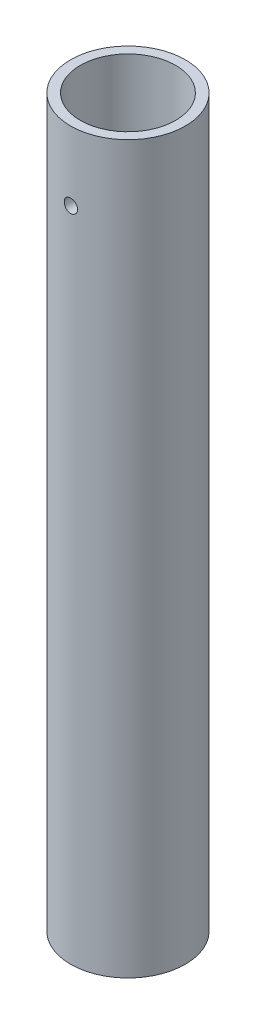
ISO-10303-21;
HEADER;
FILE_DESCRIPTION(('STEP AP214'),'2;1');
FILE_NAME('part.step','',(''),(''),'','','');
FILE_SCHEMA(('AUTOMOTIVE_DESIGN { 1 0 10303 214 1 1 1 1 }'));
ENDSEC;
DATA;
#1=APPLICATION_CONTEXT('core data for automotive mechanical design processes');
#2=APPLICATION_PROTOCOL_DEFINITION('international standard','automotive_design',2000,#1);
#3=PRODUCT_CONTEXT('',#1,'mechanical');
#4=PRODUCT('Part','Part','',(#3));
#5=PRODUCT_RELATED_PRODUCT_CATEGORY('part','',(#4));
#6=PRODUCT_DEFINITION_FORMATION('','',#4);
#7=PRODUCT_DEFINITION_CONTEXT('part definition',#1,'design');
#8=PRODUCT_DEFINITION('design','',#6,#7);
#9=PRODUCT_DEFINITION_SHAPE('','',#8);
#10=(LENGTH_UNIT() NAMED_UNIT(*) SI_UNIT(.MILLI.,.METRE.));
#11=(NAMED_UNIT(*) PLANE_ANGLE_UNIT() SI_UNIT($,.RADIAN.));
#12=(NAMED_UNIT(*) SI_UNIT($,.STERADIAN.) SOLID_ANGLE_UNIT());
#13=UNCERTAINTY_MEASURE_WITH_UNIT(LENGTH_MEASURE(1.E-05),#10,'distance_accuracy_value','');
#14=(GEOMETRIC_REPRESENTATION_CONTEXT(3) GLOBAL_UNCERTAINTY_ASSIGNED_CONTEXT((#13)) GLOBAL_UNIT_ASSIGNED_CONTEXT((#10,
#11,#12)) REPRESENTATION_CONTEXT('',''));
#15=CARTESIAN_POINT('',(0.,0.,0.));
#16=DIRECTION('',(0.,0.,1.));
#17=DIRECTION('',(1.,0.,0.));
#18=AXIS2_PLACEMENT_3D('',#15,#16,#17);
#19=CARTESIAN_POINT('',(0.,266.7,0.));
#20=DIRECTION('',(0.,1.,0.));
#21=DIRECTION('',(0.,0.,1.));
#22=AXIS2_PLACEMENT_3D('',#19,#20,#21);
#23=PLANE('',#22);
#24=CARTESIAN_POINT('',(0.,266.7,0.));
#25=DIRECTION('',(0.,1.,0.));
#26=DIRECTION('',(0.,0.,1.));
#27=AXIS2_PLACEMENT_3D('',#24,#25,#26);
#28=CIRCLE('',#27,21.082);
#29=CARTESIAN_POINT('',(0.,266.7,21.082));
#30=VERTEX_POINT('',#29);
#31=EDGE_CURVE('E60',#30,#30,#28,.T.);
#32=ORIENTED_EDGE('',*,*,#31,.T.);
#33=EDGE_LOOP('',(#32));
#34=FACE_BOUND('',#33,.T.);
#35=CARTESIAN_POINT('',(0.,266.7,0.));
#36=DIRECTION('',(0.,1.,0.));
#37=DIRECTION('',(0.,0.,1.));
#38=AXIS2_PLACEMENT_3D('',#35,#36,#37);
#39=CIRCLE('',#38,17.526);
#40=CARTESIAN_POINT('',(0.,266.7,17.526));
#41=VERTEX_POINT('',#40);
#42=EDGE_CURVE('E96',#41,#41,#39,.T.);
#43=ORIENTED_EDGE('',*,*,#42,.F.);
#44=EDGE_LOOP('',(#43));
#45=FACE_BOUND('',#44,.T.);
#46=ADVANCED_FACE('F44',(#34,#45),#23,.T.);
#47=CARTESIAN_POINT('',(0.,0.,0.));
#48=DIRECTION('',(0.,1.,0.));
#49=DIRECTION('',(0.,0.,1.));
#50=AXIS2_PLACEMENT_3D('',#47,#48,#49);
#51=PLANE('',#50);
#52=CARTESIAN_POINT('',(0.,0.,0.));
#53=DIRECTION('',(0.,1.,0.));
#54=DIRECTION('',(0.,0.,1.));
#55=AXIS2_PLACEMENT_3D('',#52,#53,#54);
#56=CIRCLE('',#55,21.082);
#57=CARTESIAN_POINT('',(0.,0.,21.082));
#58=VERTEX_POINT('',#57);
#59=EDGE_CURVE('E64',#58,#58,#56,.T.);
#60=ORIENTED_EDGE('',*,*,#59,.F.);
#61=EDGE_LOOP('',(#60));
#62=FACE_BOUND('',#61,.T.);
#63=CARTESIAN_POINT('',(0.,0.,0.));
#64=DIRECTION('',(0.,1.,0.));
#65=DIRECTION('',(0.,0.,1.));
#66=AXIS2_PLACEMENT_3D('',#63,#64,#65);
#67=CIRCLE('',#66,17.526);
#68=CARTESIAN_POINT('',(0.,0.,17.526));
#69=VERTEX_POINT('',#68);
#70=EDGE_CURVE('E95',#69,#69,#67,.T.);
#71=ORIENTED_EDGE('',*,*,#70,.T.);
#72=EDGE_LOOP('',(#71));
#73=FACE_BOUND('',#72,.T.);
#74=ADVANCED_FACE('F102',(#62,#73),#51,.F.);
#75=CARTESIAN_POINT('',(0.,266.7,0.));
#76=DIRECTION('',(0.,-1.,0.));
#77=DIRECTION('',(0.,0.,-1.));
#78=AXIS2_PLACEMENT_3D('',#75,#76,#77);
#79=CYLINDRICAL_SURFACE('',#78,21.082);
#80=CARTESIAN_POINT('',(0.,243.75745,-21.082));
#81=CARTESIAN_POINT('',(-0.137535587151129,243.757444113368,-21.0819981896699));
#82=CARTESIAN_POINT('',(-0.275158927091591,243.745864951829,-21.0806398639898));
#83=CARTESIAN_POINT('',(-0.546581132900871,243.699853296938,-21.0753518736465));
#84=CARTESIAN_POINT('',(-0.680375767190919,243.665396464516,-21.0714194705398));
#85=CARTESIAN_POINT('',(-0.940171479974279,243.574654035912,-21.0614266548056));
#86=CARTESIAN_POINT('',(-1.06617754902378,243.518382589229,-21.0553676218034));
#87=CARTESIAN_POINT('',(-1.30693195036862,243.385638009358,-21.0417967399056));
#88=CARTESIAN_POINT('',(-1.42168231936251,243.309168540248,-21.0342851545803));
#89=CARTESIAN_POINT('',(-1.63724593362092,243.1378043335,-21.0186083763947));
#90=CARTESIAN_POINT('',(-1.73799719996763,243.042831867386,-21.0104405147708));
#91=CARTESIAN_POINT('',(-1.92216922319141,242.837324190622,-20.9943934662811));
#92=CARTESIAN_POINT('',(-2.00558912743432,242.726788214758,-20.9865142936334));
#93=CARTESIAN_POINT('',(-2.15295760424343,242.492893301085,-20.9719101911828));
#94=CARTESIAN_POINT('',(-2.21684876356063,242.369497956861,-20.9651886896703));
#95=CARTESIAN_POINT('',(-2.32297949702383,242.113638090933,-20.9536955439046));
#96=CARTESIAN_POINT('',(-2.36521978780044,241.981173869567,-20.9489238351154));
#97=CARTESIAN_POINT('',(-2.42666289043977,241.711576242373,-20.9418956403549));
#98=CARTESIAN_POINT('',(-2.44596977868253,241.574466857479,-20.939627794685));
#99=CARTESIAN_POINT('',(-2.46131995575616,241.298936639866,-20.9378291899759));
#100=CARTESIAN_POINT('',(-2.4573640624055,241.160515853421,-20.938298334716));
#101=CARTESIAN_POINT('',(-2.42638652517882,240.887014543881,-20.9419103117644));
#102=CARTESIAN_POINT('',(-2.39947915811836,240.751920877759,-20.9450398973115));
#103=CARTESIAN_POINT('',(-2.3235405985702,240.48817971862,-20.9535994649235));
#104=CARTESIAN_POINT('',(-2.27450901149823,240.359532340617,-20.9590294880166));
#105=CARTESIAN_POINT('',(-2.15558981480333,240.111978403679,-20.9715932157184));
#106=CARTESIAN_POINT('',(-2.08565216967467,239.993096096093,-20.9787309993207));
#107=CARTESIAN_POINT('',(-1.92694197861826,239.768712541223,-20.9939027542921));
#108=CARTESIAN_POINT('',(-1.83816868318266,239.663211826685,-21.0019367613176));
#109=CARTESIAN_POINT('',(-1.64367202552415,239.467922658712,-21.0180546873897));
#110=CARTESIAN_POINT('',(-1.53785009251603,239.378232347655,-21.0261386164902));
#111=CARTESIAN_POINT('',(-1.31260048572371,239.217872859645,-21.0414002645652));
#112=CARTESIAN_POINT('',(-1.19317278712312,239.147203717388,-21.0485779818868));
#113=CARTESIAN_POINT('',(-0.944028858451748,239.026893986244,-21.0612221258942));
#114=CARTESIAN_POINT('',(-0.814309839696801,238.977259120374,-21.0666880867391));
#115=CARTESIAN_POINT('',(-0.548300869606908,238.900502632244,-21.075288469405));
#116=CARTESIAN_POINT('',(-0.412011185822764,238.873380094124,-21.0784229860746));
#117=CARTESIAN_POINT('',(-0.13757871173339,238.842544394849,-21.0819950339558));
#118=CARTESIAN_POINT('',(0.000548683627749443,238.838695954107,-21.0824481503478));
#119=CARTESIAN_POINT('',(0.275480478767385,238.854161301736,-21.0806483192139));
#120=CARTESIAN_POINT('',(0.412284902925746,238.873474662456,-21.0783954216509));
#121=CARTESIAN_POINT('',(0.680291365438082,238.934603045445,-21.0714464899951));
#122=CARTESIAN_POINT('',(0.811508216052588,238.976353984286,-21.0667574150722));
#123=CARTESIAN_POINT('',(1.0650770901543,239.081106021546,-21.0554614675241));
#124=CARTESIAN_POINT('',(1.18742884870696,239.144107754728,-21.0488545376131));
#125=CARTESIAN_POINT('',(1.42040130563909,239.289903253519,-21.0344214557771));
#126=CARTESIAN_POINT('',(1.5309665917273,239.37278502454,-21.02658993805));
#127=CARTESIAN_POINT('',(1.7366648265724,239.555862782572,-21.0106017013241));
#128=CARTESIAN_POINT('',(1.83179724493865,239.656059364409,-21.0024449711605));
#129=CARTESIAN_POINT('',(2.00440555916564,239.87151642908,-20.9866779589737));
#130=CARTESIAN_POINT('',(2.08179209774765,239.986848740498,-20.9790705691357));
#131=CARTESIAN_POINT('',(2.21609572148791,240.22895279811,-20.9653099402238));
#132=CARTESIAN_POINT('',(2.27301317109506,240.355724340582,-20.9591566752602));
#133=CARTESIAN_POINT('',(2.36461647986383,240.616813421065,-20.9490201779776));
#134=CARTESIAN_POINT('',(2.39935372442176,240.751112727645,-20.9450319331443));
#135=CARTESIAN_POINT('',(2.44577651593613,241.023687318341,-20.939662275977));
#136=CARTESIAN_POINT('',(2.45746298492458,241.161962443198,-20.9382807593737));
#137=CARTESIAN_POINT('',(2.45743707086335,241.437674916166,-20.9382837303195));
#138=CARTESIAN_POINT('',(2.44586505842129,241.575112298926,-20.9396516245056));
#139=CARTESIAN_POINT('',(2.39994685914769,241.846075176349,-20.9449637239783));
#140=CARTESIAN_POINT('',(2.36560066054763,241.979600668991,-20.9489079305963));
#141=CARTESIAN_POINT('',(2.27515112943169,242.238937200367,-20.9589233045321));
#142=CARTESIAN_POINT('',(2.21905362298968,242.364750294419,-20.9649939022553));
#143=CARTESIAN_POINT('',(2.08670781464675,242.605199167527,-20.9785790794334));
#144=CARTESIAN_POINT('',(2.01045939117855,242.719834879144,-20.9860936675996));
#145=CARTESIAN_POINT('',(1.83945267760812,242.935393379043,-21.0017744977369));
#146=CARTESIAN_POINT('',(1.74458969157364,243.036232858205,-21.0099442634251));
#147=CARTESIAN_POINT('',(1.53926241176635,243.220617887081,-21.0259833622734));
#148=CARTESIAN_POINT('',(1.42879442529094,243.304159331889,-21.0338526237619));
#149=CARTESIAN_POINT('',(1.19497695132096,243.451808188221,-21.0484324834556));
#150=CARTESIAN_POINT('',(1.07158583810899,243.51585003162,-21.0551391405086));
#151=CARTESIAN_POINT('',(0.815795089691324,243.622215119035,-21.0665974023545));
#152=CARTESIAN_POINT('',(0.683405560176049,243.664562285325,-21.0713511594187));
#153=CARTESIAN_POINT('',(0.458589087915354,243.716045407947,-21.0772043875154));
#154=CARTESIAN_POINT('',(0.367587332394295,243.731550218081,-21.0789941178971));
#155=CARTESIAN_POINT('',(0.184403531226216,243.752254456195,-21.0813925274694));
#156=CARTESIAN_POINT('',(0.0922214927954299,243.757453947153,-21.0820012138774));
#157=CARTESIAN_POINT('',(0.,243.75745,-21.082));
#158=B_SPLINE_CURVE_WITH_KNOTS('',3,(#80,#81,#82,#83,#84,#85,#86,#87,#88,#89,#90,#91,#92,#93,
#94,#95,#96,#97,#98,#99,#100,#101,#102,#103,#104,#105,#106,#107,#108,#109,#110,#111,#112,#113,
#114,#115,#116,#117,#118,#119,#120,#121,#122,#123,#124,#125,#126,#127,#128,#129,#130,#131,#132,
#133,#134,#135,#136,#137,#138,#139,#140,#141,#142,#143,#144,#145,#146,#147,#148,#149,#150,#151,
#152,#153,#154,#155,#156,#157),.UNSPECIFIED.,.T.,.F.,(4,2,2,2,2,2,2,2,2,2,2,2,2,2,2,2,2,2,2,2,2,
2,2,2,2,2,2,2,2,2,2,2,2,2,2,2,2,2,4),(0.,0.412269941606779,0.824979192800622,1.23742119725814,
1.64978843287183,2.06392684568482,2.4780856276406,2.89345055103031,3.30880172520549,
3.72226066186232,4.13570506318369,4.54710283560509,4.9585079455735,5.37090568455283,
5.78331983673374,6.19821019320763,6.61310130643719,7.02810523106389,7.44309227140159,
7.85566488287454,8.26822987686834,8.67962276777937,9.09102794815921,9.50428909680524,
9.91756444523795,10.3328772064412,10.7481825727001,11.162522266582,11.5768453865225,
11.9886754741001,12.4005057744902,12.812225842514,13.2239483944364,13.6380566877443,
14.0522631385876,14.4678473721359,14.8829723577925,15.1594126783116,15.4358513094848),.UNSPECIFIED.);
#159=CARTESIAN_POINT('',(0.,243.75745,-21.082));
#160=VERTEX_POINT('',#159);
#161=EDGE_CURVE('E12',#160,#160,#158,.T.);
#162=ORIENTED_EDGE('',*,*,#161,.T.);
#163=EDGE_LOOP('',(#162));
#164=FACE_BOUND('',#163,.T.);
#165=CARTESIAN_POINT('',(2.45744999999997,241.3,20.9382822480141));
#166=CARTESIAN_POINT('',(2.45744411019974,241.162467991744,20.9382841045218));
#167=CARTESIAN_POINT('',(2.44586553091842,241.024848219917,20.9396519261716));
#168=CARTESIAN_POINT('',(2.39985639892885,240.753433427284,20.9449738323792));
#169=CARTESIAN_POINT('',(2.36540149462118,240.61964264087,20.9489306728541));
#170=CARTESIAN_POINT('',(2.27466470588168,240.359855066042,20.9589764768841));
#171=CARTESIAN_POINT('',(2.21839706247105,240.233853254495,20.9650640490835));
#172=CARTESIAN_POINT('',(2.0856614402291,239.993105992693,20.9786837140271));
#173=CARTESIAN_POINT('',(2.0091971161998,239.878358510996,20.9862155453497));
#174=CARTESIAN_POINT('',(1.83783811680312,239.662791660352,21.001916300071));
#175=CARTESIAN_POINT('',(1.74286456256086,239.562035179194,21.0100878572451));
#176=CARTESIAN_POINT('',(1.5373525167563,239.377853084444,21.0261235791516));
#177=CARTESIAN_POINT('',(1.42681327424546,239.294428307482,21.0339877290301));
#178=CARTESIAN_POINT('',(1.1929154746759,239.147054716335,21.0485492343405));
#179=CARTESIAN_POINT('',(1.06952107309784,239.083162425696,21.0552431799176));
#180=CARTESIAN_POINT('',(0.813663255252876,238.977029340958,21.0666811919646));
#181=CARTESIAN_POINT('',(0.68120013377468,238.934787843455,21.0714253217802));
#182=CARTESIAN_POINT('',(0.41160597058254,238.873342247197,21.0784106361542));
#183=CARTESIAN_POINT('',(0.274498973953237,238.854033957046,21.0806631375814));
#184=CARTESIAN_POINT('',(-0.00102656033660378,238.838680148584,21.0824499927296));
#185=CARTESIAN_POINT('',(-0.139445052591945,238.842633827839,21.0819844402114));
#186=CARTESIAN_POINT('',(-0.412956075940694,238.873607840783,21.0783968360857));
#187=CARTESIAN_POINT('',(-0.548061488955433,238.900516127111,21.0752876887885));
#188=CARTESIAN_POINT('',(-0.811825666546053,238.976460589616,21.0667768421163));
#189=CARTESIAN_POINT('',(-0.940484322227949,239.025497139428,21.061375104031));
#190=CARTESIAN_POINT('',(-1.18805200322679,239.144426650325,21.0488639035828));
#191=CARTESIAN_POINT('',(-1.30693733498424,239.214368495408,21.0417504462975));
#192=CARTESIAN_POINT('',(-1.53132516076253,239.373087671141,21.0266125122783));
#193=CARTESIAN_POINT('',(-1.63682712063347,239.461865753193,21.018587999207));
#194=CARTESIAN_POINT('',(-1.83211095243771,239.656365829534,21.0024705933475));
#195=CARTESIAN_POINT('',(-1.92179564636023,239.762185411451,20.9943775776419));
#196=CARTESIAN_POINT('',(-2.08214491787267,239.987428304536,20.9790825605783));
#197=CARTESIAN_POINT('',(-2.15280944897757,240.106851648949,20.971880561398));
#198=CARTESIAN_POINT('',(-2.27311585362879,240.355994349294,20.9591828788349));
#199=CARTESIAN_POINT('',(-2.32275058881057,240.485717183575,20.95368777501));
#200=CARTESIAN_POINT('',(-2.39950564856285,240.751734454443,20.9450376478535));
#201=CARTESIAN_POINT('',(-2.42662691244394,240.888028616608,20.9418825268933));
#202=CARTESIAN_POINT('',(-2.45745779983284,241.162463250902,20.9382871537641));
#203=CARTESIAN_POINT('',(-2.46130388989729,241.300588192685,20.9378310769598));
#204=CARTESIAN_POINT('',(-2.44583471659239,241.575514517768,20.9396436168987));
#205=CARTESIAN_POINT('',(-2.4265198810966,241.71231592547,20.941912183307));
#206=CARTESIAN_POINT('',(-2.36539177561419,241.980306990534,20.9489039790577));
#207=CARTESIAN_POINT('',(-2.32364402259564,242.111511794711,20.9536200588945));
#208=CARTESIAN_POINT('',(-2.21890238639399,242.365057983439,20.9649697091935));
#209=CARTESIAN_POINT('',(-2.15590784956898,242.487399095165,20.9716033386469));
#210=CARTESIAN_POINT('',(-2.01012301336267,242.720364172145,20.9860787085831));
#211=CARTESIAN_POINT('',(-1.9272428820915,242.830931580045,20.9939258722377));
#212=CARTESIAN_POINT('',(-1.74416714396609,243.036634858552,21.0099268609532));
#213=CARTESIAN_POINT('',(-1.64397095282542,243.131770208234,21.0180806963545));
#214=CARTESIAN_POINT('',(-1.42851263514933,243.304385036439,21.0338246191306));
#215=CARTESIAN_POINT('',(-1.31317860531374,243.381775075393,21.0414117261437));
#216=CARTESIAN_POINT('',(-1.0710701603184,243.516084837822,21.0551232123828));
#217=CARTESIAN_POINT('',(-0.944295949714602,243.573004927218,21.0612476177554));
#218=CARTESIAN_POINT('',(-0.683208408027653,243.664609943258,21.0713303443191));
#219=CARTESIAN_POINT('',(-0.54891371294563,243.699347399176,21.0752937794842));
#220=CARTESIAN_POINT('',(-0.276348862556846,243.745772175366,21.0806291458089));
#221=CARTESIAN_POINT('',(-0.138078862209222,243.757460392874,21.0820011778438));
#222=CARTESIAN_POINT('',(0.137636471442606,243.757439654299,21.0819988274558));
#223=CARTESIAN_POINT('',(0.275081835934529,243.745868942141,21.0806406724236));
#224=CARTESIAN_POINT('',(0.546061005745629,243.699950538974,21.0753627011691));
#225=CARTESIAN_POINT('',(0.679594811446747,243.665602850189,21.0714428851968));
#226=CARTESIAN_POINT('',(0.938948275029041,243.575147120229,21.0614802779371));
#227=CARTESIAN_POINT('',(1.06476994756527,243.519044790359,21.055438043893));
#228=CARTESIAN_POINT('',(1.30523397020142,243.386686673607,21.041901271535));
#229=CARTESIAN_POINT('',(1.4198762581952,243.310430774773,21.0344067251536));
#230=CARTESIAN_POINT('',(1.63543458664254,243.139415750508,21.0187497824404));
#231=CARTESIAN_POINT('',(1.73626867166931,243.044553644694,21.010583823207));
#232=CARTESIAN_POINT('',(1.92064322782068,242.839230356925,20.9945336194599));
#233=CARTESIAN_POINT('',(2.00417957978507,242.728765469945,20.9866494424169));
#234=CARTESIAN_POINT('',(2.15182285129791,242.494950609237,20.9720271331899));
#235=CARTESIAN_POINT('',(2.2158633147345,242.371558448961,20.9652929545289));
#236=CARTESIAN_POINT('',(2.32222553364891,242.11576549846,20.9537796223097));
#237=CARTESIAN_POINT('',(2.36457122881468,241.983374821484,20.9489983149889));
#238=CARTESIAN_POINT('',(2.41605027829372,241.758562270667,20.9431093678139));
#239=CARTESIAN_POINT('',(2.43155325507291,241.667565871026,20.9413080464585));
#240=CARTESIAN_POINT('',(2.45225505823439,241.484392794884,20.9388938678798));
#241=CARTESIAN_POINT('',(2.45745394915018,241.392216125779,20.9382810032133));
#242=CARTESIAN_POINT('',(2.45744999999997,241.3,20.9382822480141));
#243=B_SPLINE_CURVE_WITH_KNOTS('',3,(#165,#166,#167,#168,#169,#170,#171,#172,#173,#174,#175,
#176,#177,#178,#179,#180,#181,#182,#183,#184,#185,#186,#187,#188,#189,#190,#191,#192,#193,#194,
#195,#196,#197,#198,#199,#200,#201,#202,#203,#204,#205,#206,#207,#208,#209,#210,#211,#212,#213,
#214,#215,#216,#217,#218,#219,#220,#221,#222,#223,#224,#225,#226,#227,#228,#229,#230,#231,#232,
#233,#234,#235,#236,#237,#238,#239,#240,#241,#242),.UNSPECIFIED.,.T.,.F.,(4,2,2,2,2,2,2,2,2,2,2,
2,2,2,2,2,2,2,2,2,2,2,2,2,2,2,2,2,2,2,2,2,2,2,2,2,2,2,4),(0.,0.41225919053067,0.824957931587855,
1.23738768395281,1.64974285388285,2.06389533753674,2.47806780834557,2.89342771647984,
3.3087741292888,3.72222621022227,4.13566402898655,4.54709522337292,4.95853336501783,
5.37094122361879,5.78336553684368,6.19824155054137,6.61311857818108,7.02813631928388,
7.44313674408087,7.85570157028064,8.26825877489964,8.67961757350439,9.09098902841903,
9.5042550258661,9.91753497064728,10.332854249664,10.7481661040428,11.1624908018752,
11.5767993709888,11.9886526987889,12.4005059863738,12.8122512221382,13.2239987451891,
13.6380929850237,14.0522857212252,14.4678749128306,14.8830045179998,15.1594287769651,
15.4358513047063),.UNSPECIFIED.);
#244=CARTESIAN_POINT('',(2.45744999999997,241.3,20.9382822480141));
#245=VERTEX_POINT('',#244);
#246=EDGE_CURVE('E56',#245,#245,#243,.T.);
#247=ORIENTED_EDGE('',*,*,#246,.T.);
#248=EDGE_LOOP('',(#247));
#249=FACE_BOUND('',#248,.T.);
#250=ORIENTED_EDGE('',*,*,#31,.F.);
#251=EDGE_LOOP('',(#250));
#252=FACE_BOUND('',#251,.T.);
#253=ORIENTED_EDGE('',*,*,#59,.T.);
#254=EDGE_LOOP('',(#253));
#255=FACE_BOUND('',#254,.T.);
#256=ADVANCED_FACE('F46',(#164,#249,#252,#255),#79,.T.);
#257=CARTESIAN_POINT('',(0.,266.7,0.));
#258=DIRECTION('',(0.,-1.,0.));
#259=DIRECTION('',(0.,0.,-1.));
#260=AXIS2_PLACEMENT_3D('',#257,#258,#259);
#261=CYLINDRICAL_SURFACE('',#260,17.526);
#262=CARTESIAN_POINT('',(0.,243.75745,-17.526));
#263=CARTESIAN_POINT('',(-0.137313584698908,243.757444262247,-17.5259979035797));
#264=CARTESIAN_POINT('',(-0.27470938098926,243.745902271459,-17.5243692864859));
#265=CARTESIAN_POINT('',(-0.545667633177904,243.700046925665,-17.5180291139445));
#266=CARTESIAN_POINT('',(-0.679226104788651,243.665710735807,-17.5133144670296));
#267=CARTESIAN_POINT('',(-0.938548610824723,243.575307148025,-17.5013325963352));
#268=CARTESIAN_POINT('',(-1.06431819611891,243.519255437609,-17.4940672155858));
#269=CARTESIAN_POINT('',(-1.30464510431337,243.387048649461,-17.4777888529064));
#270=CARTESIAN_POINT('',(-1.41920413091019,243.310896632945,-17.4687761371458));
#271=CARTESIAN_POINT('',(-1.63466536201847,243.14009334655,-17.4499378396296));
#272=CARTESIAN_POINT('',(-1.73547949463127,243.045331478553,-17.4401076113061));
#273=CARTESIAN_POINT('',(-1.91982986195649,242.840236283307,-17.4207790315578));
#274=CARTESIAN_POINT('',(-2.00336515134966,242.729902104657,-17.4112806983145));
#275=CARTESIAN_POINT('',(-2.15112359612904,242.496210152974,-17.3936460725588));
#276=CARTESIAN_POINT('',(-2.21526260813034,242.372798685905,-17.3855157804919));
#277=CARTESIAN_POINT('',(-2.32187026625513,242.116822252377,-17.3716004592687));
#278=CARTESIAN_POINT('',(-2.36433994384768,241.98425772195,-17.365815318485));
#279=CARTESIAN_POINT('',(-2.42613216297916,241.71465985157,-17.3572905463897));
#280=CARTESIAN_POINT('',(-2.44560470188291,241.577661526178,-17.35453118815));
#281=CARTESIAN_POINT('',(-2.46131435003581,241.302316023101,-17.3523103486831));
#282=CARTESIAN_POINT('',(-2.45755262774421,241.163968913594,-17.3528487016127));
#283=CARTESIAN_POINT('',(-2.42702333872361,240.890906695555,-17.3571444091685));
#284=CARTESIAN_POINT('',(-2.40042207065976,240.756172575762,-17.3608784944864));
#285=CARTESIAN_POINT('',(-2.32522877274597,240.493099429306,-17.3711086086991));
#286=CARTESIAN_POINT('',(-2.2766361930729,240.364760562625,-17.3776047066491));
#287=CARTESIAN_POINT('',(-2.15866430036943,240.117610628605,-17.3926528916365));
#288=CARTESIAN_POINT('',(-2.08921379664041,239.998833987651,-17.4012119999095));
#289=CARTESIAN_POINT('',(-1.93154829160256,239.774557755089,-17.4194166021337));
#290=CARTESIAN_POINT('',(-1.84333221225987,239.669058926812,-17.4290621584836));
#291=CARTESIAN_POINT('',(-1.64972321655843,239.473368631844,-17.4484559312095));
#292=CARTESIAN_POINT('',(-1.54418716980886,239.383318728914,-17.4582043091126));
#293=CARTESIAN_POINT('',(-1.31942389369263,239.222188351203,-17.4766269583257));
#294=CARTESIAN_POINT('',(-1.2001966172448,239.151107941656,-17.4853012259417));
#295=CARTESIAN_POINT('',(-0.951318187232498,239.029929956328,-17.5006057657572));
#296=CARTESIAN_POINT('',(-0.821662065406638,238.9798424529,-17.5072350563791));
#297=CARTESIAN_POINT('',(-0.555665446583874,238.902190724937,-17.5176942501772));
#298=CARTESIAN_POINT('',(-0.419325344493214,238.874625171445,-17.5215243185263));
#299=CARTESIAN_POINT('',(-0.145053668180906,238.842986102272,-17.5259318188799));
#300=CARTESIAN_POINT('',(-0.00714498008645091,238.838717806524,-17.5265362186008));
#301=CARTESIAN_POINT('',(0.267420012463899,238.853278636268,-17.5244974452953));
#302=CARTESIAN_POINT('',(0.404076350570307,238.872107139308,-17.5218543597877));
#303=CARTESIAN_POINT('',(0.671673768066677,238.932165177893,-17.5136343037714));
#304=CARTESIAN_POINT('',(0.802636369403381,238.97330065006,-17.5080696559355));
#305=CARTESIAN_POINT('',(1.05580531527904,239.07670632634,-17.494628790179));
#306=CARTESIAN_POINT('',(1.17801129412722,239.138977412487,-17.4867524757895));
#307=CARTESIAN_POINT('',(1.41106006458366,239.283349517641,-17.4694975275255));
#308=CARTESIAN_POINT('',(1.52182498726752,239.365575102169,-17.4601095863565));
#309=CARTESIAN_POINT('',(1.72805234000045,239.547347550135,-17.4409076104019));
#310=CARTESIAN_POINT('',(1.82351399776281,239.646895287215,-17.431093554144));
#311=CARTESIAN_POINT('',(1.99712650568201,239.861349691057,-17.4120608789176));
#312=CARTESIAN_POINT('',(2.07514737326774,239.97636207662,-17.4028470714761));
#313=CARTESIAN_POINT('',(2.21076236927751,240.217973838594,-17.3861408657778));
#314=CARTESIAN_POINT('',(2.26835699313536,240.344572933877,-17.3786484257712));
#315=CARTESIAN_POINT('',(2.3612794150893,240.605363752403,-17.3662673267763));
#316=CARTESIAN_POINT('',(2.39667762308562,240.739529980373,-17.361370442077));
#317=CARTESIAN_POINT('',(2.44442764786373,241.011976197678,-17.35471234094));
#318=CARTESIAN_POINT('',(2.45678083937191,241.150255941125,-17.3529509374588));
#319=CARTESIAN_POINT('',(2.45806054060964,241.425709448809,-17.3527696031538));
#320=CARTESIAN_POINT('',(2.44719134212329,241.562882288918,-17.3543205330566));
#321=CARTESIAN_POINT('',(2.40277045238329,241.833429585809,-17.3605260693105));
#322=CARTESIAN_POINT('',(2.36921878010966,241.966804045767,-17.3651806730646));
#323=CARTESIAN_POINT('',(2.28045421447676,242.225924134982,-17.3770593966485));
#324=CARTESIAN_POINT('',(2.225253788378,242.351674107052,-17.3842820373532));
#325=CARTESIAN_POINT('',(2.09477878698059,242.592160477115,-17.400485067998));
#326=CARTESIAN_POINT('',(2.01950370652993,242.706896597861,-17.4094655021691));
#327=CARTESIAN_POINT('',(1.85026722412442,242.923139091537,-17.4282665869345));
#328=CARTESIAN_POINT('',(1.75615406109157,243.02452614537,-17.4380936659363));
#329=CARTESIAN_POINT('',(1.5522328957237,243.210142719056,-17.4574258134156));
#330=CARTESIAN_POINT('',(1.44242123133023,243.29436822441,-17.4669308061169));
#331=CARTESIAN_POINT('',(1.20960726248237,243.443624932687,-17.4845991900352));
#332=CARTESIAN_POINT('',(1.08654436529854,243.50856237925,-17.4927559452655));
#333=CARTESIAN_POINT('',(0.831207201776107,243.616752085084,-17.5067430950473));
#334=CARTESIAN_POINT('',(0.698942839466522,243.660027261568,-17.5125759467915));
#335=CARTESIAN_POINT('',(0.471705182020455,243.713621684123,-17.519895641402));
#336=CARTESIAN_POINT('',(0.378147818276056,243.730032810765,-17.522173271037));
#337=CARTESIAN_POINT('',(0.189740047370786,243.751948895679,-17.5252261670435));
#338=CARTESIAN_POINT('',(0.0948896533902708,243.757453965037,-17.5260014487175));
#339=CARTESIAN_POINT('',(0.,243.75745,-17.526));
#340=B_SPLINE_CURVE_WITH_KNOTS('',3,(#262,#263,#264,#265,#266,#267,#268,#269,#270,#271,#272,
#273,#274,#275,#276,#277,#278,#279,#280,#281,#282,#283,#284,#285,#286,#287,#288,#289,#290,#291,
#292,#293,#294,#295,#296,#297,#298,#299,#300,#301,#302,#303,#304,#305,#306,#307,#308,#309,#310,
#311,#312,#313,#314,#315,#316,#317,#318,#319,#320,#321,#322,#323,#324,#325,#326,#327,#328,#329,
#330,#331,#332,#333,#334,#335,#336,#337,#338,#339),.UNSPECIFIED.,.T.,.F.,(4,2,2,2,2,2,2,2,2,2,2,
2,2,2,2,2,2,2,2,2,2,2,2,2,2,2,2,2,2,2,2,2,2,2,2,2,2,2,4),(0.,0.411594074113731,
0.823601099863358,1.23531104097032,1.64695831600512,2.06113037740567,2.47532509201983,
2.89129167521458,3.3072384563845,3.72045699906312,4.13365476100361,4.5438692283703,
4.95409395241794,5.36573505181141,5.77739980531212,6.1926557544199,6.60791313154556,
7.02336952086855,7.43880139350359,7.85075460655059,8.26269671781037,8.67291511996532,
9.08315064353472,9.49601608401864,9.90890235340314,10.3247701537904,10.7406278667107,
11.1551596616744,11.5696667273861,11.9805423182014,12.3914175652087,12.8020565406702,
13.2127058502911,13.626807145415,14.0410051978756,14.4571848396401,14.8729232561056,
15.1573555425078,15.4417849317469),.UNSPECIFIED.);
#341=CARTESIAN_POINT('',(0.,243.75745,-17.526));
#342=VERTEX_POINT('',#341);
#343=EDGE_CURVE('E89',#342,#342,#340,.T.);
#344=ORIENTED_EDGE('',*,*,#343,.F.);
#345=EDGE_LOOP('',(#344));
#346=FACE_BOUND('',#345,.T.);
#347=CARTESIAN_POINT('',(2.45744999999997,241.3,17.3528561193107));
#348=CARTESIAN_POINT('',(2.45744425576781,241.162693895738,17.3528582939303));
#349=CARTESIAN_POINT('',(2.44590348004675,241.025305559006,17.3545034086685));
#350=CARTESIAN_POINT('',(2.40005339872059,240.754362803301,17.3609024781592));
#351=CARTESIAN_POINT('',(2.3657212315311,240.620812374532,17.3656595543875));
#352=CARTESIAN_POINT('',(2.27532940885055,240.361506883719,17.3777333854527));
#353=CARTESIAN_POINT('',(2.21928563131456,240.235746202718,17.385048269355));
#354=CARTESIAN_POINT('',(2.08709753079151,239.995434245218,17.4014112813078));
#355=CARTESIAN_POINT('',(2.01095624988984,239.880881275843,17.4104591469864));
#356=CARTESIAN_POINT('',(1.84016386164743,239.665413332606,17.4293396169182));
#357=CARTESIAN_POINT('',(1.74539975298671,239.564588319185,17.4391767834153));
#358=CARTESIAN_POINT('',(1.5402954908282,239.380216915157,17.4584866165296));
#359=CARTESIAN_POINT('',(1.42995451580117,239.296671436451,17.4679592638884));
#360=CARTESIAN_POINT('',(1.19625648272944,239.148902235041,17.4855201030188));
#361=CARTESIAN_POINT('',(1.07284689996682,239.084760812199,17.4936023367598));
#362=CARTESIAN_POINT('',(0.816874557612614,238.978148178908,17.507421317107));
#363=CARTESIAN_POINT('',(0.684312222359955,238.9356759646,17.5131581723643));
#364=CARTESIAN_POINT('',(0.414721589694922,238.873878594523,17.5216078406156));
#365=CARTESIAN_POINT('',(0.277728363103437,238.854403168929,17.5243402774558));
#366=CARTESIAN_POINT('',(0.00239288164659168,238.838685980198,17.526540397484));
#367=CARTESIAN_POINT('',(-0.135949306924444,238.842443080995,17.5260082403102));
#368=CARTESIAN_POINT('',(-0.409031630685112,238.872964950569,17.5217548920635));
#369=CARTESIAN_POINT('',(-0.543790230666998,238.89956807682,17.5180561064079));
#370=CARTESIAN_POINT('',(-0.806911374062331,238.97477353677,17.507910106928));
#371=CARTESIAN_POINT('',(-0.935273770024571,239.023376377365,17.5014628297757));
#372=CARTESIAN_POINT('',(-1.18245262327647,239.141369723796,17.4865056623644));
#373=CARTESIAN_POINT('',(-1.30123579433166,239.210829060881,17.4779889605619));
#374=CARTESIAN_POINT('',(-1.52552136163071,239.368513531246,17.4598436566784));
#375=CARTESIAN_POINT('',(-1.63102299211327,239.456739745763,17.4502149905473));
#376=CARTESIAN_POINT('',(-1.82670222399162,239.650356060561,17.4308234314385));
#377=CARTESIAN_POINT('',(-1.91674029617486,239.755887189963,17.4210600961358));
#378=CARTESIAN_POINT('',(-2.077849128115,239.980636366734,17.4025807150533));
#379=CARTESIAN_POINT('',(-2.1489197972395,240.099854479501,17.393864674278));
#380=CARTESIAN_POINT('',(-2.2700907210565,240.348730159716,17.3784669999731));
#381=CARTESIAN_POINT('',(-2.32017794368848,240.478394155306,17.371786631426));
#382=CARTESIAN_POINT('',(-2.39782670962005,240.744407928021,17.3612399589177));
#383=CARTESIAN_POINT('',(-2.42538963129811,240.880757295492,17.3573734827616));
#384=CARTESIAN_POINT('',(-2.45701874762099,241.155033700953,17.3529245910052));
#385=CARTESIAN_POINT('',(-2.46128214216191,241.292937567231,17.3523146144345));
#386=CARTESIAN_POINT('',(-2.44671323083266,241.567491748917,17.3543747330287));
#387=CARTESIAN_POINT('',(-2.42788154838769,241.704142098062,17.3570447396541));
#388=CARTESIAN_POINT('',(-2.3678238040632,241.971707574773,17.3653387369066));
#389=CARTESIAN_POINT('',(-2.32669484819526,242.102644930464,17.3709499150622));
#390=CARTESIAN_POINT('',(-2.22331063154656,242.355766257756,17.384483532915));
#391=CARTESIAN_POINT('',(-2.16105444983477,242.4779498475,17.3924060733617));
#392=CARTESIAN_POINT('',(-2.01670466072649,242.710982681603,17.4097351363622));
#393=CARTESIAN_POINT('',(-1.93448271178947,242.821751710888,17.4191511172617));
#394=CARTESIAN_POINT('',(-1.75271501697401,243.027989035567,17.4383771502165));
#395=CARTESIAN_POINT('',(-1.65316841856528,243.123456577545,17.4481872216463));
#396=CARTESIAN_POINT('',(-1.43871159437114,243.297082777015,17.4671816331099));
#397=CARTESIAN_POINT('',(-1.32369541766583,243.375111199585,17.4763609321432));
#398=CARTESIAN_POINT('',(-1.08207396523996,243.510739437844,17.4929824658017));
#399=CARTESIAN_POINT('',(-0.955468973289725,243.56833975358,17.5004247429448));
#400=CARTESIAN_POINT('',(-0.694681088864029,243.661265736931,17.5127114926727));
#401=CARTESIAN_POINT('',(-0.560524580075032,243.696664278119,17.5175644563258));
#402=CARTESIAN_POINT('',(-0.28809893978139,243.744418259065,17.5241612734945));
#403=CARTESIAN_POINT('',(-0.149830044669334,243.756775020744,17.5259053053712));
#404=CARTESIAN_POINT('',(0.125628839539996,243.758065535469,17.526086359181));
#405=CARTESIAN_POINT('',(0.262817915909909,243.747199184576,17.524551603759));
#406=CARTESIAN_POINT('',(0.533398418294167,243.702778295696,17.5184040870773));
#407=CARTESIAN_POINT('',(0.666789852196642,243.669223804839,17.5137913322114));
#408=CARTESIAN_POINT('',(0.925945409921702,243.580446764018,17.502003651957));
#409=CARTESIAN_POINT('',(1.05171374928935,243.525236318297,17.4948301580527));
#410=CARTESIAN_POINT('',(1.2922327014285,243.394735561966,17.4787115419892));
#411=CARTESIAN_POINT('',(1.40698304837424,243.319444767053,17.4697663771018));
#412=CARTESIAN_POINT('',(1.62322585418706,243.150190523308,17.4510088020753));
#413=CARTESIAN_POINT('',(1.7246018095329,243.056078937162,17.441189878523));
#414=CARTESIAN_POINT('',(1.91019672448408,242.852165556098,17.4218413096777));
#415=CARTESIAN_POINT('',(1.99441163991201,242.7423600731,17.4123117330216));
#416=CARTESIAN_POINT('',(2.1436563845052,242.509551604003,17.3945711687127));
#417=CARTESIAN_POINT('',(2.20859069838794,242.386486897816,17.38636683471));
#418=CARTESIAN_POINT('',(2.31677405303749,242.131146002629,17.3722835678308));
#419=CARTESIAN_POINT('',(2.36004604613413,241.998879733177,17.3664021750809));
#420=CARTESIAN_POINT('',(2.41363190542745,241.771650502737,17.3590183028928));
#421=CARTESIAN_POINT('',(2.43003918265614,241.678104070269,17.3567194250902));
#422=CARTESIAN_POINT('',(2.45195015698543,241.489718170957,17.3536375899737));
#423=CARTESIAN_POINT('',(2.45745396927275,241.394878717782,17.3528546166454));
#424=CARTESIAN_POINT('',(2.45744999999997,241.3,17.3528561193107));
#425=B_SPLINE_CURVE_WITH_KNOTS('',3,(#347,#348,#349,#350,#351,#352,#353,#354,#355,#356,#357,
#358,#359,#360,#361,#362,#363,#364,#365,#366,#367,#368,#369,#370,#371,#372,#373,#374,#375,#376,
#377,#378,#379,#380,#381,#382,#383,#384,#385,#386,#387,#388,#389,#390,#391,#392,#393,#394,#395,
#396,#397,#398,#399,#400,#401,#402,#403,#404,#405,#406,#407,#408,#409,#410,#411,#412,#413,#414,
#415,#416,#417,#418,#419,#420,#421,#422,#423,#424),.UNSPECIFIED.,.T.,.F.,(4,2,2,2,2,2,2,2,2,2,2,
2,2,2,2,2,2,2,2,2,2,2,2,2,2,2,2,2,2,2,2,2,2,2,2,2,2,2,4),(0.,0.411571599619736,
0.823556663461483,1.23524100482393,1.64686306673723,2.06106454625575,2.47528787906873,
2.89124422090772,3.30718129115583,3.72038515841011,4.13356882021898,4.5438529442574,
4.95414652217304,5.3658093305657,5.77749586295441,6.1927214501107,6.60794902131392,
7.02343409442094,7.43889373994276,7.85083155570491,8.26275825192132,8.67290522670845,
9.08307008200709,9.49594475206286,9.90883974505416,10.3247222072455,10.7405944886256,
11.155094495953,11.5695707224236,11.9804936658869,12.3914157557549,12.8021084939879,
13.2128111383167,13.6268835252503,14.0410533800833,14.4572420348643,14.8729887783102,
15.1573883568329,15.4417849308769),.UNSPECIFIED.);
#426=CARTESIAN_POINT('',(2.45744999999997,241.3,17.3528561193107));
#427=VERTEX_POINT('',#426);
#428=EDGE_CURVE('E84',#427,#427,#425,.T.);
#429=ORIENTED_EDGE('',*,*,#428,.F.);
#430=EDGE_LOOP('',(#429));
#431=FACE_BOUND('',#430,.T.);
#432=ORIENTED_EDGE('',*,*,#42,.T.);
#433=EDGE_LOOP('',(#432));
#434=FACE_BOUND('',#433,.T.);
#435=ORIENTED_EDGE('',*,*,#70,.F.);
#436=EDGE_LOOP('',(#435));
#437=FACE_BOUND('',#436,.T.);
#438=ADVANCED_FACE('F76',(#346,#431,#434,#437),#261,.F.);
#439=CARTESIAN_POINT('',(0.,241.3,21.082));
#440=DIRECTION('',(0.,0.,1.));
#441=DIRECTION('',(1.,0.,0.));
#442=AXIS2_PLACEMENT_3D('',#439,#440,#441);
#443=CYLINDRICAL_SURFACE('',#442,2.45744999999999);
#444=ORIENTED_EDGE('',*,*,#428,.T.);
#445=EDGE_LOOP('',(#444));
#446=FACE_BOUND('',#445,.T.);
#447=ORIENTED_EDGE('',*,*,#246,.F.);
#448=EDGE_LOOP('',(#447));
#449=FACE_BOUND('',#448,.T.);
#450=ADVANCED_FACE('F74',(#446,#449),#443,.F.);
#451=ORIENTED_EDGE('',*,*,#343,.T.);
#452=EDGE_LOOP('',(#451));
#453=FACE_BOUND('',#452,.T.);
#454=ORIENTED_EDGE('',*,*,#161,.F.);
#455=EDGE_LOOP('',(#454));
#456=FACE_BOUND('',#455,.T.);
#457=ADVANCED_FACE('F70',(#453,#456),#443,.F.);
#458=CLOSED_SHELL('',(#46,#74,#256,#438,#450,#457));
#459=MANIFOLD_SOLID_BREP('B2',#458);
#460=ADVANCED_BREP_SHAPE_REPRESENTATION('',(#18,#459),#14);
#461=SHAPE_DEFINITION_REPRESENTATION(#9,#460);
ENDSEC;
END-ISO-10303-21;
